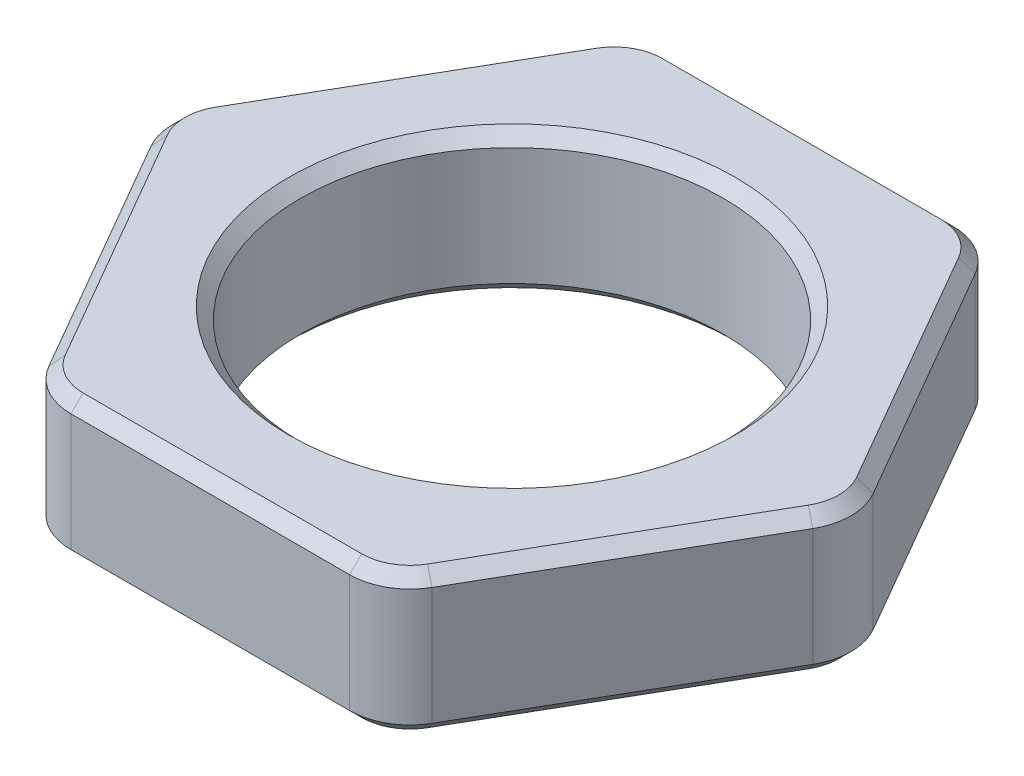
ISO-10303-21;
HEADER;
FILE_DESCRIPTION(('STEP AP214'),'2;1');
FILE_NAME('part.step','',(''),(''),'','','');
FILE_SCHEMA(('AUTOMOTIVE_DESIGN { 1 0 10303 214 1 1 1 1 }'));
ENDSEC;
DATA;
#1=APPLICATION_CONTEXT('core data for automotive mechanical design processes');
#2=APPLICATION_PROTOCOL_DEFINITION('international standard','automotive_design',2000,#1);
#3=PRODUCT_CONTEXT('',#1,'mechanical');
#4=PRODUCT('Part','Part','',(#3));
#5=PRODUCT_RELATED_PRODUCT_CATEGORY('part','',(#4));
#6=PRODUCT_DEFINITION_FORMATION('','',#4);
#7=PRODUCT_DEFINITION_CONTEXT('part definition',#1,'design');
#8=PRODUCT_DEFINITION('design','',#6,#7);
#9=PRODUCT_DEFINITION_SHAPE('','',#8);
#10=(LENGTH_UNIT() NAMED_UNIT(*) SI_UNIT(.MILLI.,.METRE.));
#11=(NAMED_UNIT(*) PLANE_ANGLE_UNIT() SI_UNIT($,.RADIAN.));
#12=(NAMED_UNIT(*) SI_UNIT($,.STERADIAN.) SOLID_ANGLE_UNIT());
#13=UNCERTAINTY_MEASURE_WITH_UNIT(LENGTH_MEASURE(1.E-05),#10,'distance_accuracy_value','');
#14=(GEOMETRIC_REPRESENTATION_CONTEXT(3) GLOBAL_UNCERTAINTY_ASSIGNED_CONTEXT((#13)) GLOBAL_UNIT_ASSIGNED_CONTEXT((#10,
#11,#12)) REPRESENTATION_CONTEXT('',''));
#15=CARTESIAN_POINT('',(0.,0.,0.));
#16=DIRECTION('',(0.,0.,1.));
#17=DIRECTION('',(1.,0.,0.));
#18=AXIS2_PLACEMENT_3D('',#15,#16,#17);
#19=CARTESIAN_POINT('',(0.,1.175,0.));
#20=DIRECTION('',(0.,1.,0.));
#21=DIRECTION('',(0.,0.,1.));
#22=AXIS2_PLACEMENT_3D('',#19,#20,#21);
#23=PLANE('',#22);
#24=CARTESIAN_POINT('',(0.,1.175,0.));
#25=DIRECTION('',(0.,1.,0.));
#26=DIRECTION('',(0.,0.,1.));
#27=AXIS2_PLACEMENT_3D('',#24,#25,#26);
#28=CIRCLE('',#27,3.7);
#29=CARTESIAN_POINT('',(0.,1.175,3.7));
#30=VERTEX_POINT('',#29);
#31=EDGE_CURVE('E11',#30,#30,#28,.F.);
#32=ORIENTED_EDGE('',*,*,#31,.T.);
#33=EDGE_LOOP('',(#32));
#34=FACE_BOUND('',#33,.T.);
#35=DIRECTION('',(1.,0.,0.));
#36=VECTOR('',#35,1.);
#37=CARTESIAN_POINT('',(2.3094010767585,1.175,4.8));
#38=LINE('',#37,#36);
#39=CARTESIAN_POINT('',(-2.3094010767585,1.175,4.8));
#40=VERTEX_POINT('',#39);
#41=CARTESIAN_POINT('',(2.3094010767585,1.175,4.8));
#42=VERTEX_POINT('',#41);
#43=EDGE_CURVE('E49',#40,#42,#38,.T.);
#44=ORIENTED_EDGE('',*,*,#43,.T.);
#45=CARTESIAN_POINT('',(2.3094010767585,1.175,4.));
#46=DIRECTION('',(0.,1.,0.));
#47=DIRECTION('',(0.,0.,1.));
#48=AXIS2_PLACEMENT_3D('',#45,#46,#47);
#49=CIRCLE('',#48,0.799999999999999);
#50=CARTESIAN_POINT('',(3.00222139978605,1.175,4.4));
#51=VERTEX_POINT('',#50);
#52=EDGE_CURVE('E41',#42,#51,#49,.T.);
#53=ORIENTED_EDGE('',*,*,#52,.T.);
#54=DIRECTION('',(0.5,0.,-0.866025403784439));
#55=VECTOR('',#54,1.);
#56=CARTESIAN_POINT('',(5.31162247654456,1.175,0.399999999999996));
#57=LINE('',#56,#55);
#58=CARTESIAN_POINT('',(5.31162247654456,1.175,0.399999999999997));
#59=VERTEX_POINT('',#58);
#60=EDGE_CURVE('E283',#51,#59,#57,.T.);
#61=ORIENTED_EDGE('',*,*,#60,.T.);
#62=CARTESIAN_POINT('',(4.61880215351701,1.175,0.));
#63=DIRECTION('',(0.,1.,0.));
#64=DIRECTION('',(0.,0.,1.));
#65=AXIS2_PLACEMENT_3D('',#62,#63,#64);
#66=CIRCLE('',#65,0.8);
#67=CARTESIAN_POINT('',(5.31162247654456,1.175,-0.400000000000003));
#68=VERTEX_POINT('',#67);
#69=EDGE_CURVE('E285',#59,#68,#66,.T.);
#70=ORIENTED_EDGE('',*,*,#69,.T.);
#71=DIRECTION('',(-0.5,0.,-0.866025403784439));
#72=VECTOR('',#71,1.);
#73=CARTESIAN_POINT('',(3.00222139978605,1.175,-4.4));
#74=LINE('',#73,#72);
#75=CARTESIAN_POINT('',(3.00222139978605,1.175,-4.4));
#76=VERTEX_POINT('',#75);
#77=EDGE_CURVE('E287',#68,#76,#74,.T.);
#78=ORIENTED_EDGE('',*,*,#77,.T.);
#79=CARTESIAN_POINT('',(2.3094010767585,1.175,-4.));
#80=DIRECTION('',(0.,1.,0.));
#81=DIRECTION('',(0.,0.,1.));
#82=AXIS2_PLACEMENT_3D('',#79,#80,#81);
#83=CIRCLE('',#82,0.799999999999999);
#84=CARTESIAN_POINT('',(2.3094010767585,1.175,-4.8));
#85=VERTEX_POINT('',#84);
#86=EDGE_CURVE('E289',#76,#85,#83,.T.);
#87=ORIENTED_EDGE('',*,*,#86,.T.);
#88=DIRECTION('',(-1.,0.,0.));
#89=VECTOR('',#88,1.);
#90=CARTESIAN_POINT('',(-2.3094010767585,1.175,-4.8));
#91=LINE('',#90,#89);
#92=CARTESIAN_POINT('',(-2.3094010767585,1.175,-4.8));
#93=VERTEX_POINT('',#92);
#94=EDGE_CURVE('E291',#85,#93,#91,.T.);
#95=ORIENTED_EDGE('',*,*,#94,.T.);
#96=CARTESIAN_POINT('',(-2.3094010767585,1.175,-4.));
#97=DIRECTION('',(0.,1.,0.));
#98=DIRECTION('',(0.,0.,1.));
#99=AXIS2_PLACEMENT_3D('',#96,#97,#98);
#100=CIRCLE('',#99,0.799999999999999);
#101=CARTESIAN_POINT('',(-3.00222139978605,1.175,-4.4));
#102=VERTEX_POINT('',#101);
#103=EDGE_CURVE('E293',#93,#102,#100,.T.);
#104=ORIENTED_EDGE('',*,*,#103,.T.);
#105=DIRECTION('',(-0.5,0.,0.866025403784439));
#106=VECTOR('',#105,1.);
#107=CARTESIAN_POINT('',(-5.31162247654456,1.175,-0.399999999999997));
#108=LINE('',#107,#106);
#109=CARTESIAN_POINT('',(-5.31162247654456,1.175,-0.399999999999999));
#110=VERTEX_POINT('',#109);
#111=EDGE_CURVE('E295',#102,#110,#108,.T.);
#112=ORIENTED_EDGE('',*,*,#111,.T.);
#113=CARTESIAN_POINT('',(-4.61880215351701,1.175,0.));
#114=DIRECTION('',(0.,1.,0.));
#115=DIRECTION('',(0.,0.,1.));
#116=AXIS2_PLACEMENT_3D('',#113,#114,#115);
#117=CIRCLE('',#116,0.8);
#118=CARTESIAN_POINT('',(-5.31162247654456,1.175,0.4));
#119=VERTEX_POINT('',#118);
#120=EDGE_CURVE('E297',#110,#119,#117,.T.);
#121=ORIENTED_EDGE('',*,*,#120,.T.);
#122=DIRECTION('',(0.5,0.,0.866025403784439));
#123=VECTOR('',#122,1.);
#124=CARTESIAN_POINT('',(-3.00222139978605,1.175,4.4));
#125=LINE('',#124,#123);
#126=CARTESIAN_POINT('',(-3.00222139978605,1.175,4.4));
#127=VERTEX_POINT('',#126);
#128=EDGE_CURVE('E299',#119,#127,#125,.T.);
#129=ORIENTED_EDGE('',*,*,#128,.T.);
#130=CARTESIAN_POINT('',(-2.3094010767585,1.175,4.));
#131=DIRECTION('',(0.,1.,0.));
#132=DIRECTION('',(0.,0.,1.));
#133=AXIS2_PLACEMENT_3D('',#130,#131,#132);
#134=CIRCLE('',#133,0.799999999999999);
#135=EDGE_CURVE('E54',#127,#40,#134,.T.);
#136=ORIENTED_EDGE('',*,*,#135,.T.);
#137=EDGE_LOOP('',(#44,#53,#61,#70,#78,#87,#95,#104,#112,#121,#129,#136));
#138=FACE_BOUND('',#137,.T.);
#139=ADVANCED_FACE('F32',(#34,#138),#23,.T.);
#140=CARTESIAN_POINT('',(0.,-1.175,0.));
#141=DIRECTION('',(0.,1.,0.));
#142=DIRECTION('',(0.,0.,1.));
#143=AXIS2_PLACEMENT_3D('',#140,#141,#142);
#144=PLANE('',#143);
#145=CARTESIAN_POINT('',(0.,-1.175,0.));
#146=DIRECTION('',(0.,1.,0.));
#147=DIRECTION('',(0.,0.,1.));
#148=AXIS2_PLACEMENT_3D('',#145,#146,#147);
#149=CIRCLE('',#148,3.7);
#150=CARTESIAN_POINT('',(0.,-1.175,3.7));
#151=VERTEX_POINT('',#150);
#152=EDGE_CURVE('E221',#151,#151,#149,.T.);
#153=ORIENTED_EDGE('',*,*,#152,.T.);
#154=EDGE_LOOP('',(#153));
#155=FACE_BOUND('',#154,.T.);
#156=DIRECTION('',(1.,0.,0.));
#157=VECTOR('',#156,1.);
#158=CARTESIAN_POINT('',(0.,-1.175,-4.8));
#159=LINE('',#158,#157);
#160=CARTESIAN_POINT('',(-2.3094010767585,-1.175,-4.8));
#161=VERTEX_POINT('',#160);
#162=CARTESIAN_POINT('',(2.3094010767585,-1.175,-4.8));
#163=VERTEX_POINT('',#162);
#164=EDGE_CURVE('E219',#161,#163,#159,.T.);
#165=ORIENTED_EDGE('',*,*,#164,.T.);
#166=CARTESIAN_POINT('',(2.3094010767585,-1.175,-4.));
#167=DIRECTION('',(0.,1.,0.));
#168=DIRECTION('',(0.,0.,1.));
#169=AXIS2_PLACEMENT_3D('',#166,#167,#168);
#170=CIRCLE('',#169,0.799999999999997);
#171=CARTESIAN_POINT('',(3.00222139978605,-1.175,-4.4));
#172=VERTEX_POINT('',#171);
#173=EDGE_CURVE('E200',#163,#172,#170,.F.);
#174=ORIENTED_EDGE('',*,*,#173,.T.);
#175=DIRECTION('',(0.5,0.,0.866025403784439));
#176=VECTOR('',#175,1.);
#177=CARTESIAN_POINT('',(4.15692193816531,-1.175,-2.4));
#178=LINE('',#177,#176);
#179=CARTESIAN_POINT('',(5.31162247654456,-1.175,-0.400000000000001));
#180=VERTEX_POINT('',#179);
#181=EDGE_CURVE('E208',#172,#180,#178,.T.);
#182=ORIENTED_EDGE('',*,*,#181,.T.);
#183=CARTESIAN_POINT('',(4.61880215351701,-1.175,0.));
#184=DIRECTION('',(0.,1.,0.));
#185=DIRECTION('',(0.,0.,1.));
#186=AXIS2_PLACEMENT_3D('',#183,#184,#185);
#187=CIRCLE('',#186,0.799999999999997);
#188=CARTESIAN_POINT('',(5.31162247654456,-1.175,0.399999999999996));
#189=VERTEX_POINT('',#188);
#190=EDGE_CURVE('E214',#180,#189,#187,.F.);
#191=ORIENTED_EDGE('',*,*,#190,.T.);
#192=DIRECTION('',(-0.5,0.,0.866025403784439));
#193=VECTOR('',#192,1.);
#194=CARTESIAN_POINT('',(4.1569219381653,-1.175,2.4));
#195=LINE('',#194,#193);
#196=CARTESIAN_POINT('',(3.00222139978605,-1.175,4.4));
#197=VERTEX_POINT('',#196);
#198=EDGE_CURVE('E397',#189,#197,#195,.T.);
#199=ORIENTED_EDGE('',*,*,#198,.T.);
#200=CARTESIAN_POINT('',(2.3094010767585,-1.175,4.));
#201=DIRECTION('',(0.,1.,0.));
#202=DIRECTION('',(0.,0.,1.));
#203=AXIS2_PLACEMENT_3D('',#200,#201,#202);
#204=CIRCLE('',#203,0.799999999999997);
#205=CARTESIAN_POINT('',(2.3094010767585,-1.175,4.8));
#206=VERTEX_POINT('',#205);
#207=EDGE_CURVE('E399',#197,#206,#204,.F.);
#208=ORIENTED_EDGE('',*,*,#207,.T.);
#209=DIRECTION('',(-1.,0.,0.));
#210=VECTOR('',#209,1.);
#211=CARTESIAN_POINT('',(0.,-1.175,4.8));
#212=LINE('',#211,#210);
#213=CARTESIAN_POINT('',(-2.3094010767585,-1.175,4.8));
#214=VERTEX_POINT('',#213);
#215=EDGE_CURVE('E401',#206,#214,#212,.T.);
#216=ORIENTED_EDGE('',*,*,#215,.T.);
#217=CARTESIAN_POINT('',(-2.3094010767585,-1.175,4.));
#218=DIRECTION('',(0.,1.,0.));
#219=DIRECTION('',(0.,0.,1.));
#220=AXIS2_PLACEMENT_3D('',#217,#218,#219);
#221=CIRCLE('',#220,0.799999999999997);
#222=CARTESIAN_POINT('',(-3.00222139978605,-1.175,4.4));
#223=VERTEX_POINT('',#222);
#224=EDGE_CURVE('E403',#214,#223,#221,.F.);
#225=ORIENTED_EDGE('',*,*,#224,.T.);
#226=DIRECTION('',(-0.5,0.,-0.866025403784439));
#227=VECTOR('',#226,1.);
#228=CARTESIAN_POINT('',(-4.1569219381653,-1.175,2.4));
#229=LINE('',#228,#227);
#230=CARTESIAN_POINT('',(-5.31162247654455,-1.175,0.399999999999998));
#231=VERTEX_POINT('',#230);
#232=EDGE_CURVE('E405',#223,#231,#229,.T.);
#233=ORIENTED_EDGE('',*,*,#232,.T.);
#234=CARTESIAN_POINT('',(-4.61880215351701,-1.175,0.));
#235=DIRECTION('',(0.,1.,0.));
#236=DIRECTION('',(0.,0.,1.));
#237=AXIS2_PLACEMENT_3D('',#234,#235,#236);
#238=CIRCLE('',#237,0.799999999999997);
#239=CARTESIAN_POINT('',(-5.31162247654455,-1.175,-0.399999999999997));
#240=VERTEX_POINT('',#239);
#241=EDGE_CURVE('E407',#231,#240,#238,.F.);
#242=ORIENTED_EDGE('',*,*,#241,.T.);
#243=DIRECTION('',(0.5,0.,-0.866025403784439));
#244=VECTOR('',#243,1.);
#245=CARTESIAN_POINT('',(-4.1569219381653,-1.175,-2.4));
#246=LINE('',#245,#244);
#247=CARTESIAN_POINT('',(-3.00222139978605,-1.175,-4.4));
#248=VERTEX_POINT('',#247);
#249=EDGE_CURVE('E409',#240,#248,#246,.T.);
#250=ORIENTED_EDGE('',*,*,#249,.T.);
#251=CARTESIAN_POINT('',(-2.3094010767585,-1.175,-4.));
#252=DIRECTION('',(0.,1.,0.));
#253=DIRECTION('',(0.,0.,1.));
#254=AXIS2_PLACEMENT_3D('',#251,#252,#253);
#255=CIRCLE('',#254,0.799999999999997);
#256=EDGE_CURVE('E226',#248,#161,#255,.F.);
#257=ORIENTED_EDGE('',*,*,#256,.T.);
#258=EDGE_LOOP('',(#165,#174,#182,#191,#199,#208,#216,#225,#233,#242,#250,#257));
#259=FACE_BOUND('',#258,.T.);
#260=ADVANCED_FACE('F217',(#155,#259),#144,.F.);
#261=CARTESIAN_POINT('',(5.77350269189626,1.175,0.));
#262=DIRECTION('',(-0.866025403784439,0.,0.5));
#263=DIRECTION('',(0.5,0.,0.866025403784439));
#264=AXIS2_PLACEMENT_3D('',#261,#262,#263);
#265=PLANE('',#264);
#266=DIRECTION('',(0.,-1.,0.));
#267=VECTOR('',#266,1.);
#268=CARTESIAN_POINT('',(5.48482755730145,1.175,-0.500000000000003));
#269=LINE('',#268,#267);
#270=CARTESIAN_POINT('',(5.48482755730145,0.975,-0.500000000000003));
#271=VERTEX_POINT('',#270);
#272=CARTESIAN_POINT('',(5.48482755730145,-0.974999999999997,-0.500000000000003));
#273=VERTEX_POINT('',#272);
#274=EDGE_CURVE('E426',#271,#273,#269,.T.);
#275=ORIENTED_EDGE('',*,*,#274,.T.);
#276=DIRECTION('',(-0.5,0.,-0.866025403784439));
#277=VECTOR('',#276,1.);
#278=CARTESIAN_POINT('',(5.77350269189626,-0.974999999999997,0.));
#279=LINE('',#278,#277);
#280=CARTESIAN_POINT('',(3.17542648054294,-0.974999999999997,-4.5));
#281=VERTEX_POINT('',#280);
#282=EDGE_CURVE('E281',#273,#281,#279,.T.);
#283=ORIENTED_EDGE('',*,*,#282,.T.);
#284=DIRECTION('',(0.,-1.,0.));
#285=VECTOR('',#284,1.);
#286=CARTESIAN_POINT('',(3.17542648054294,1.175,-4.5));
#287=LINE('',#286,#285);
#288=CARTESIAN_POINT('',(3.17542648054294,0.975,-4.5));
#289=VERTEX_POINT('',#288);
#290=EDGE_CURVE('E333',#281,#289,#287,.F.);
#291=ORIENTED_EDGE('',*,*,#290,.T.);
#292=DIRECTION('',(0.5,0.,0.866025403784439));
#293=VECTOR('',#292,1.);
#294=CARTESIAN_POINT('',(5.48482755730145,0.975,-0.500000000000003));
#295=LINE('',#294,#293);
#296=EDGE_CURVE('E279',#289,#271,#295,.T.);
#297=ORIENTED_EDGE('',*,*,#296,.T.);
#298=EDGE_LOOP('',(#275,#283,#291,#297));
#299=FACE_BOUND('',#298,.T.);
#300=ADVANCED_FACE('F484',(#299),#265,.F.);
#301=CARTESIAN_POINT('',(2.88675134594813,1.175,-5.));
#302=DIRECTION('',(0.,0.,1.));
#303=DIRECTION('',(1.,0.,0.));
#304=AXIS2_PLACEMENT_3D('',#301,#302,#303);
#305=PLANE('',#304);
#306=DIRECTION('',(0.,-1.,0.));
#307=VECTOR('',#306,1.);
#308=CARTESIAN_POINT('',(2.3094010767585,1.175,-5.));
#309=LINE('',#308,#307);
#310=CARTESIAN_POINT('',(2.3094010767585,0.975,-5.));
#311=VERTEX_POINT('',#310);
#312=CARTESIAN_POINT('',(2.3094010767585,-0.974999999999998,-5.));
#313=VERTEX_POINT('',#312);
#314=EDGE_CURVE('E390',#311,#313,#309,.T.);
#315=ORIENTED_EDGE('',*,*,#314,.T.);
#316=DIRECTION('',(-1.,0.,0.));
#317=VECTOR('',#316,1.);
#318=CARTESIAN_POINT('',(2.88675134594813,-0.974999999999998,-5.));
#319=LINE('',#318,#317);
#320=CARTESIAN_POINT('',(-2.3094010767585,-0.974999999999998,-5.));
#321=VERTEX_POINT('',#320);
#322=EDGE_CURVE('E240',#313,#321,#319,.T.);
#323=ORIENTED_EDGE('',*,*,#322,.T.);
#324=DIRECTION('',(0.,-1.,0.));
#325=VECTOR('',#324,1.);
#326=CARTESIAN_POINT('',(-2.3094010767585,1.175,-5.));
#327=LINE('',#326,#325);
#328=CARTESIAN_POINT('',(-2.3094010767585,0.975,-5.));
#329=VERTEX_POINT('',#328);
#330=EDGE_CURVE('E215',#321,#329,#327,.F.);
#331=ORIENTED_EDGE('',*,*,#330,.T.);
#332=DIRECTION('',(1.,0.,0.));
#333=VECTOR('',#332,1.);
#334=CARTESIAN_POINT('',(2.3094010767585,0.975,-5.));
#335=LINE('',#334,#333);
#336=EDGE_CURVE('E238',#329,#311,#335,.T.);
#337=ORIENTED_EDGE('',*,*,#336,.T.);
#338=EDGE_LOOP('',(#315,#323,#331,#337));
#339=FACE_BOUND('',#338,.T.);
#340=ADVANCED_FACE('F387',(#339),#305,.F.);
#341=CARTESIAN_POINT('',(-2.88675134594813,1.175,-5.));
#342=DIRECTION('',(0.866025403784439,0.,0.5));
#343=DIRECTION('',(0.5,0.,-0.866025403784439));
#344=AXIS2_PLACEMENT_3D('',#341,#342,#343);
#345=PLANE('',#344);
#346=DIRECTION('',(0.,-1.,0.));
#347=VECTOR('',#346,1.);
#348=CARTESIAN_POINT('',(-3.17542648054294,1.175,-4.5));
#349=LINE('',#348,#347);
#350=CARTESIAN_POINT('',(-3.17542648054294,0.975,-4.5));
#351=VERTEX_POINT('',#350);
#352=CARTESIAN_POINT('',(-3.17542648054294,-0.974999999999998,-4.5));
#353=VERTEX_POINT('',#352);
#354=EDGE_CURVE('E384',#351,#353,#349,.T.);
#355=ORIENTED_EDGE('',*,*,#354,.T.);
#356=DIRECTION('',(-0.5,0.,0.866025403784439));
#357=VECTOR('',#356,1.);
#358=CARTESIAN_POINT('',(-2.88675134594813,-0.974999999999998,-5.));
#359=LINE('',#358,#357);
#360=CARTESIAN_POINT('',(-5.48482755730145,-0.974999999999998,-0.5));
#361=VERTEX_POINT('',#360);
#362=EDGE_CURVE('E248',#353,#361,#359,.T.);
#363=ORIENTED_EDGE('',*,*,#362,.T.);
#364=DIRECTION('',(0.,-1.,0.));
#365=VECTOR('',#364,1.);
#366=CARTESIAN_POINT('',(-5.48482755730145,1.175,-0.5));
#367=LINE('',#366,#365);
#368=CARTESIAN_POINT('',(-5.48482755730145,0.974999999999999,-0.5));
#369=VERTEX_POINT('',#368);
#370=EDGE_CURVE('E392',#361,#369,#367,.F.);
#371=ORIENTED_EDGE('',*,*,#370,.T.);
#372=DIRECTION('',(0.5,0.,-0.866025403784439));
#373=VECTOR('',#372,1.);
#374=CARTESIAN_POINT('',(-3.17542648054294,0.974999999999999,-4.5));
#375=LINE('',#374,#373);
#376=EDGE_CURVE('E246',#369,#351,#375,.T.);
#377=ORIENTED_EDGE('',*,*,#376,.T.);
#378=EDGE_LOOP('',(#355,#363,#371,#377));
#379=FACE_BOUND('',#378,.T.);
#380=ADVANCED_FACE('F452',(#379),#345,.F.);
#381=CARTESIAN_POINT('',(-5.77350269189626,1.175,0.));
#382=DIRECTION('',(0.866025403784439,0.,-0.5));
#383=DIRECTION('',(-0.5,0.,-0.866025403784439));
#384=AXIS2_PLACEMENT_3D('',#381,#382,#383);
#385=PLANE('',#384);
#386=DIRECTION('',(0.,-1.,0.));
#387=VECTOR('',#386,1.);
#388=CARTESIAN_POINT('',(-5.48482755730145,1.175,0.5));
#389=LINE('',#388,#387);
#390=CARTESIAN_POINT('',(-5.48482755730145,0.975,0.5));
#391=VERTEX_POINT('',#390);
#392=CARTESIAN_POINT('',(-5.48482755730145,-0.974999999999998,0.5));
#393=VERTEX_POINT('',#392);
#394=EDGE_CURVE('E446',#391,#393,#389,.T.);
#395=ORIENTED_EDGE('',*,*,#394,.T.);
#396=DIRECTION('',(0.5,0.,0.866025403784439));
#397=VECTOR('',#396,1.);
#398=CARTESIAN_POINT('',(-5.77350269189626,-0.974999999999998,0.));
#399=LINE('',#398,#397);
#400=CARTESIAN_POINT('',(-3.17542648054294,-0.974999999999998,4.5));
#401=VERTEX_POINT('',#400);
#402=EDGE_CURVE('E256',#393,#401,#399,.T.);
#403=ORIENTED_EDGE('',*,*,#402,.T.);
#404=DIRECTION('',(0.,-1.,0.));
#405=VECTOR('',#404,1.);
#406=CARTESIAN_POINT('',(-3.17542648054294,1.175,4.5));
#407=LINE('',#406,#405);
#408=CARTESIAN_POINT('',(-3.17542648054294,0.975,4.5));
#409=VERTEX_POINT('',#408);
#410=EDGE_CURVE('E443',#401,#409,#407,.F.);
#411=ORIENTED_EDGE('',*,*,#410,.T.);
#412=DIRECTION('',(-0.5,0.,-0.866025403784439));
#413=VECTOR('',#412,1.);
#414=CARTESIAN_POINT('',(-5.48482755730145,0.975,0.5));
#415=LINE('',#414,#413);
#416=EDGE_CURVE('E254',#409,#391,#415,.T.);
#417=ORIENTED_EDGE('',*,*,#416,.T.);
#418=EDGE_LOOP('',(#395,#403,#411,#417));
#419=FACE_BOUND('',#418,.T.);
#420=ADVANCED_FACE('F497',(#419),#385,.F.);
#421=CARTESIAN_POINT('',(-2.88675134594813,1.175,5.));
#422=DIRECTION('',(0.,0.,-1.));
#423=DIRECTION('',(-1.,0.,0.));
#424=AXIS2_PLACEMENT_3D('',#421,#422,#423);
#425=PLANE('',#424);
#426=DIRECTION('',(0.,-1.,0.));
#427=VECTOR('',#426,1.);
#428=CARTESIAN_POINT('',(-2.3094010767585,1.175,5.));
#429=LINE('',#428,#427);
#430=CARTESIAN_POINT('',(-2.3094010767585,0.975,5.));
#431=VERTEX_POINT('',#430);
#432=CARTESIAN_POINT('',(-2.3094010767585,-0.974999999999998,5.));
#433=VERTEX_POINT('',#432);
#434=EDGE_CURVE('E437',#431,#433,#429,.T.);
#435=ORIENTED_EDGE('',*,*,#434,.T.);
#436=DIRECTION('',(1.,0.,0.));
#437=VECTOR('',#436,1.);
#438=CARTESIAN_POINT('',(-2.88675134594813,-0.974999999999998,5.));
#439=LINE('',#438,#437);
#440=CARTESIAN_POINT('',(2.3094010767585,-0.974999999999998,5.));
#441=VERTEX_POINT('',#440);
#442=EDGE_CURVE('E264',#433,#441,#439,.T.);
#443=ORIENTED_EDGE('',*,*,#442,.T.);
#444=DIRECTION('',(0.,-1.,0.));
#445=VECTOR('',#444,1.);
#446=CARTESIAN_POINT('',(2.3094010767585,1.175,5.));
#447=LINE('',#446,#445);
#448=CARTESIAN_POINT('',(2.3094010767585,0.975,5.));
#449=VERTEX_POINT('',#448);
#450=EDGE_CURVE('E440',#441,#449,#447,.F.);
#451=ORIENTED_EDGE('',*,*,#450,.T.);
#452=DIRECTION('',(-1.,0.,0.));
#453=VECTOR('',#452,1.);
#454=CARTESIAN_POINT('',(-2.3094010767585,0.975,5.));
#455=LINE('',#454,#453);
#456=EDGE_CURVE('E262',#449,#431,#455,.T.);
#457=ORIENTED_EDGE('',*,*,#456,.T.);
#458=EDGE_LOOP('',(#435,#443,#451,#457));
#459=FACE_BOUND('',#458,.T.);
#460=ADVANCED_FACE('F493',(#459),#425,.F.);
#461=CARTESIAN_POINT('',(2.88675134594813,1.175,5.));
#462=DIRECTION('',(-0.866025403784439,0.,-0.5));
#463=DIRECTION('',(-0.5,0.,0.866025403784439));
#464=AXIS2_PLACEMENT_3D('',#461,#462,#463);
#465=PLANE('',#464);
#466=DIRECTION('',(0.,-1.,0.));
#467=VECTOR('',#466,1.);
#468=CARTESIAN_POINT('',(3.17542648054294,1.175,4.5));
#469=LINE('',#468,#467);
#470=CARTESIAN_POINT('',(3.17542648054294,0.974999999999999,4.5));
#471=VERTEX_POINT('',#470);
#472=CARTESIAN_POINT('',(3.17542648054294,-0.974999999999998,4.5));
#473=VERTEX_POINT('',#472);
#474=EDGE_CURVE('E429',#471,#473,#469,.T.);
#475=ORIENTED_EDGE('',*,*,#474,.T.);
#476=DIRECTION('',(0.5,0.,-0.866025403784439));
#477=VECTOR('',#476,1.);
#478=CARTESIAN_POINT('',(2.88675134594813,-0.974999999999998,5.));
#479=LINE('',#478,#477);
#480=CARTESIAN_POINT('',(5.48482755730145,-0.974999999999998,0.499999999999997));
#481=VERTEX_POINT('',#480);
#482=EDGE_CURVE('E273',#473,#481,#479,.T.);
#483=ORIENTED_EDGE('',*,*,#482,.T.);
#484=DIRECTION('',(0.,-1.,0.));
#485=VECTOR('',#484,1.);
#486=CARTESIAN_POINT('',(5.48482755730145,1.175,0.499999999999997));
#487=LINE('',#486,#485);
#488=CARTESIAN_POINT('',(5.48482755730145,0.975,0.499999999999997));
#489=VERTEX_POINT('',#488);
#490=EDGE_CURVE('E434',#481,#489,#487,.F.);
#491=ORIENTED_EDGE('',*,*,#490,.T.);
#492=DIRECTION('',(-0.5,0.,0.866025403784439));
#493=VECTOR('',#492,1.);
#494=CARTESIAN_POINT('',(3.17542648054294,0.974999999999999,4.5));
#495=LINE('',#494,#493);
#496=EDGE_CURVE('E271',#489,#471,#495,.T.);
#497=ORIENTED_EDGE('',*,*,#496,.T.);
#498=EDGE_LOOP('',(#475,#483,#491,#497));
#499=FACE_BOUND('',#498,.T.);
#500=ADVANCED_FACE('F490',(#499),#465,.F.);
#501=CARTESIAN_POINT('',(0.,1.175,0.));
#502=DIRECTION('',(0.,-1.,0.));
#503=DIRECTION('',(0.,0.,-1.));
#504=AXIS2_PLACEMENT_3D('',#501,#502,#503);
#505=CYLINDRICAL_SURFACE('',#504,3.5);
#506=CARTESIAN_POINT('',(0.,-0.974999999999997,0.));
#507=DIRECTION('',(0.,1.,0.));
#508=DIRECTION('',(0.,0.,1.));
#509=AXIS2_PLACEMENT_3D('',#506,#507,#508);
#510=CIRCLE('',#509,3.5);
#511=CARTESIAN_POINT('',(0.,-0.974999999999997,3.5));
#512=VERTEX_POINT('',#511);
#513=EDGE_CURVE('E232',#512,#512,#510,.F.);
#514=ORIENTED_EDGE('',*,*,#513,.T.);
#515=EDGE_LOOP('',(#514));
#516=FACE_BOUND('',#515,.T.);
#517=CARTESIAN_POINT('',(0.,0.975,0.));
#518=DIRECTION('',(0.,1.,0.));
#519=DIRECTION('',(0.,0.,1.));
#520=AXIS2_PLACEMENT_3D('',#517,#518,#519);
#521=CIRCLE('',#520,3.5);
#522=CARTESIAN_POINT('',(0.,0.975,3.5));
#523=VERTEX_POINT('',#522);
#524=EDGE_CURVE('E224',#523,#523,#521,.T.);
#525=ORIENTED_EDGE('',*,*,#524,.T.);
#526=EDGE_LOOP('',(#525));
#527=FACE_BOUND('',#526,.T.);
#528=ADVANCED_FACE('F488',(#516,#527),#505,.F.);
#529=CARTESIAN_POINT('',(4.61880215351701,1.175,0.));
#530=DIRECTION('',(0.,-1.,0.));
#531=DIRECTION('',(0.,0.,-1.));
#532=AXIS2_PLACEMENT_3D('',#529,#530,#531);
#533=CYLINDRICAL_SURFACE('',#532,1.);
#534=ORIENTED_EDGE('',*,*,#490,.F.);
#535=CARTESIAN_POINT('',(4.61880215351701,-0.974999999999998,0.));
#536=DIRECTION('',(0.,1.,0.));
#537=DIRECTION('',(0.,0.,1.));
#538=AXIS2_PLACEMENT_3D('',#535,#536,#537);
#539=CIRCLE('',#538,1.);
#540=EDGE_CURVE('E277',#481,#273,#539,.T.);
#541=ORIENTED_EDGE('',*,*,#540,.T.);
#542=ORIENTED_EDGE('',*,*,#274,.F.);
#543=CARTESIAN_POINT('',(4.61880215351701,0.975,0.));
#544=DIRECTION('',(0.,1.,0.));
#545=DIRECTION('',(0.,0.,1.));
#546=AXIS2_PLACEMENT_3D('',#543,#544,#545);
#547=CIRCLE('',#546,1.);
#548=EDGE_CURVE('E275',#271,#489,#547,.F.);
#549=ORIENTED_EDGE('',*,*,#548,.T.);
#550=EDGE_LOOP('',(#534,#541,#542,#549));
#551=FACE_BOUND('',#550,.T.);
#552=ADVANCED_FACE('F508',(#551),#533,.T.);
#553=CARTESIAN_POINT('',(2.3094010767585,1.175,4.));
#554=DIRECTION('',(0.,-1.,0.));
#555=DIRECTION('',(0.,0.,-1.));
#556=AXIS2_PLACEMENT_3D('',#553,#554,#555);
#557=CYLINDRICAL_SURFACE('',#556,1.);
#558=ORIENTED_EDGE('',*,*,#450,.F.);
#559=CARTESIAN_POINT('',(2.3094010767585,-0.974999999999998,4.));
#560=DIRECTION('',(0.,1.,0.));
#561=DIRECTION('',(0.,0.,1.));
#562=AXIS2_PLACEMENT_3D('',#559,#560,#561);
#563=CIRCLE('',#562,1.);
#564=EDGE_CURVE('E269',#441,#473,#563,.T.);
#565=ORIENTED_EDGE('',*,*,#564,.T.);
#566=ORIENTED_EDGE('',*,*,#474,.F.);
#567=CARTESIAN_POINT('',(2.3094010767585,0.975,4.));
#568=DIRECTION('',(0.,1.,0.));
#569=DIRECTION('',(0.,0.,1.));
#570=AXIS2_PLACEMENT_3D('',#567,#568,#569);
#571=CIRCLE('',#570,1.);
#572=EDGE_CURVE('E266',#471,#449,#571,.F.);
#573=ORIENTED_EDGE('',*,*,#572,.T.);
#574=EDGE_LOOP('',(#558,#565,#566,#573));
#575=FACE_BOUND('',#574,.T.);
#576=ADVANCED_FACE('F511',(#575),#557,.T.);
#577=CARTESIAN_POINT('',(-4.61880215351701,1.175,0.));
#578=DIRECTION('',(0.,-1.,0.));
#579=DIRECTION('',(0.,0.,-1.));
#580=AXIS2_PLACEMENT_3D('',#577,#578,#579);
#581=CYLINDRICAL_SURFACE('',#580,1.);
#582=ORIENTED_EDGE('',*,*,#370,.F.);
#583=CARTESIAN_POINT('',(-4.61880215351701,-0.974999999999998,0.));
#584=DIRECTION('',(0.,1.,0.));
#585=DIRECTION('',(0.,0.,1.));
#586=AXIS2_PLACEMENT_3D('',#583,#584,#585);
#587=CIRCLE('',#586,1.);
#588=EDGE_CURVE('E252',#361,#393,#587,.T.);
#589=ORIENTED_EDGE('',*,*,#588,.T.);
#590=ORIENTED_EDGE('',*,*,#394,.F.);
#591=CARTESIAN_POINT('',(-4.61880215351701,0.975,0.));
#592=DIRECTION('',(0.,1.,0.));
#593=DIRECTION('',(0.,0.,1.));
#594=AXIS2_PLACEMENT_3D('',#591,#592,#593);
#595=CIRCLE('',#594,1.);
#596=EDGE_CURVE('E250',#391,#369,#595,.F.);
#597=ORIENTED_EDGE('',*,*,#596,.T.);
#598=EDGE_LOOP('',(#582,#589,#590,#597));
#599=FACE_BOUND('',#598,.T.);
#600=ADVANCED_FACE('F456',(#599),#581,.T.);
#601=CARTESIAN_POINT('',(-2.3094010767585,1.175,-4.));
#602=DIRECTION('',(0.,-1.,0.));
#603=DIRECTION('',(0.,0.,-1.));
#604=AXIS2_PLACEMENT_3D('',#601,#602,#603);
#605=CYLINDRICAL_SURFACE('',#604,1.);
#606=ORIENTED_EDGE('',*,*,#330,.F.);
#607=CARTESIAN_POINT('',(-2.3094010767585,-0.974999999999998,-4.));
#608=DIRECTION('',(0.,1.,0.));
#609=DIRECTION('',(0.,0.,1.));
#610=AXIS2_PLACEMENT_3D('',#607,#608,#609);
#611=CIRCLE('',#610,1.);
#612=EDGE_CURVE('E244',#321,#353,#611,.T.);
#613=ORIENTED_EDGE('',*,*,#612,.T.);
#614=ORIENTED_EDGE('',*,*,#354,.F.);
#615=CARTESIAN_POINT('',(-2.3094010767585,0.975,-4.));
#616=DIRECTION('',(0.,1.,0.));
#617=DIRECTION('',(0.,0.,1.));
#618=AXIS2_PLACEMENT_3D('',#615,#616,#617);
#619=CIRCLE('',#618,1.);
#620=EDGE_CURVE('E242',#351,#329,#619,.F.);
#621=ORIENTED_EDGE('',*,*,#620,.T.);
#622=EDGE_LOOP('',(#606,#613,#614,#621));
#623=FACE_BOUND('',#622,.T.);
#624=ADVANCED_FACE('F381',(#623),#605,.T.);
#625=CARTESIAN_POINT('',(2.3094010767585,1.175,-4.));
#626=DIRECTION('',(0.,-1.,0.));
#627=DIRECTION('',(0.,0.,-1.));
#628=AXIS2_PLACEMENT_3D('',#625,#626,#627);
#629=CYLINDRICAL_SURFACE('',#628,1.);
#630=ORIENTED_EDGE('',*,*,#290,.F.);
#631=CARTESIAN_POINT('',(2.3094010767585,-0.974999999999998,-4.));
#632=DIRECTION('',(0.,1.,0.));
#633=DIRECTION('',(0.,0.,1.));
#634=AXIS2_PLACEMENT_3D('',#631,#632,#633);
#635=CIRCLE('',#634,1.);
#636=EDGE_CURVE('E202',#281,#313,#635,.T.);
#637=ORIENTED_EDGE('',*,*,#636,.T.);
#638=ORIENTED_EDGE('',*,*,#314,.F.);
#639=CARTESIAN_POINT('',(2.3094010767585,0.975,-4.));
#640=DIRECTION('',(0.,1.,0.));
#641=DIRECTION('',(0.,0.,1.));
#642=AXIS2_PLACEMENT_3D('',#639,#640,#641);
#643=CIRCLE('',#642,1.);
#644=EDGE_CURVE('E235',#311,#289,#643,.F.);
#645=ORIENTED_EDGE('',*,*,#644,.T.);
#646=EDGE_LOOP('',(#630,#637,#638,#645));
#647=FACE_BOUND('',#646,.T.);
#648=ADVANCED_FACE('F420',(#647),#629,.T.);
#649=CARTESIAN_POINT('',(-2.3094010767585,1.175,4.));
#650=DIRECTION('',(0.,-1.,0.));
#651=DIRECTION('',(0.,0.,-1.));
#652=AXIS2_PLACEMENT_3D('',#649,#650,#651);
#653=CYLINDRICAL_SURFACE('',#652,1.);
#654=ORIENTED_EDGE('',*,*,#410,.F.);
#655=CARTESIAN_POINT('',(-2.3094010767585,-0.974999999999998,4.));
#656=DIRECTION('',(0.,1.,0.));
#657=DIRECTION('',(0.,0.,1.));
#658=AXIS2_PLACEMENT_3D('',#655,#656,#657);
#659=CIRCLE('',#658,1.);
#660=EDGE_CURVE('E260',#401,#433,#659,.T.);
#661=ORIENTED_EDGE('',*,*,#660,.T.);
#662=ORIENTED_EDGE('',*,*,#434,.F.);
#663=CARTESIAN_POINT('',(-2.3094010767585,0.975,4.));
#664=DIRECTION('',(0.,1.,0.));
#665=DIRECTION('',(0.,0.,1.));
#666=AXIS2_PLACEMENT_3D('',#663,#664,#665);
#667=CIRCLE('',#666,1.);
#668=EDGE_CURVE('E258',#431,#409,#667,.F.);
#669=ORIENTED_EDGE('',*,*,#668,.T.);
#670=EDGE_LOOP('',(#654,#661,#662,#669));
#671=FACE_BOUND('',#670,.T.);
#672=ADVANCED_FACE('F522',(#671),#653,.T.);
#673=CARTESIAN_POINT('',(0.,-1.175,0.));
#674=DIRECTION('',(0.,-1.,0.));
#675=DIRECTION('',(0.,0.,-1.));
#676=AXIS2_PLACEMENT_3D('',#673,#674,#675);
#677=CONICAL_SURFACE('',#676,3.7,0.785398163397443);
#678=ORIENTED_EDGE('',*,*,#513,.F.);
#679=EDGE_LOOP('',(#678));
#680=FACE_BOUND('',#679,.T.);
#681=ORIENTED_EDGE('',*,*,#152,.F.);
#682=EDGE_LOOP('',(#681));
#683=FACE_BOUND('',#682,.T.);
#684=ADVANCED_FACE('F525',(#680,#683),#677,.F.);
#685=CARTESIAN_POINT('',(-2.3094010767585,-1.175,4.));
#686=DIRECTION('',(0.,1.,0.));
#687=DIRECTION('',(0.,0.,1.));
#688=AXIS2_PLACEMENT_3D('',#685,#686,#687);
#689=CONICAL_SURFACE('',#688,0.799999999999997,0.78539816339745);
#690=DIRECTION('',(0.,-0.707106781186546,-0.707106781186549));
#691=VECTOR('',#690,1.);
#692=CARTESIAN_POINT('',(-2.3094010767585,-0.974999999999998,5.));
#693=LINE('',#692,#691);
#694=EDGE_CURVE('E327',#433,#214,#693,.T.);
#695=ORIENTED_EDGE('',*,*,#694,.F.);
#696=ORIENTED_EDGE('',*,*,#660,.F.);
#697=DIRECTION('',(-0.612372435695796,0.707106781186547,0.353553390593273));
#698=VECTOR('',#697,1.);
#699=CARTESIAN_POINT('',(-3.00222139978605,-1.175,4.4));
#700=LINE('',#699,#698);
#701=EDGE_CURVE('E330',#223,#401,#700,.T.);
#702=ORIENTED_EDGE('',*,*,#701,.F.);
#703=ORIENTED_EDGE('',*,*,#224,.F.);
#704=EDGE_LOOP('',(#695,#696,#702,#703));
#705=FACE_BOUND('',#704,.T.);
#706=ADVANCED_FACE('F529',(#705),#689,.T.);
#707=CARTESIAN_POINT('',(-5.77350269189626,-0.974999999999998,0.));
#708=DIRECTION('',(0.612372435695794,0.707106781186548,-0.353553390593274));
#709=DIRECTION('',(0.5,0.,0.866025403784439));
#710=AXIS2_PLACEMENT_3D('',#707,#708,#709);
#711=PLANE('',#710);
#712=ORIENTED_EDGE('',*,*,#701,.T.);
#713=ORIENTED_EDGE('',*,*,#402,.F.);
#714=DIRECTION('',(-0.612372435695795,0.707106781186547,0.353553390593275));
#715=VECTOR('',#714,1.);
#716=CARTESIAN_POINT('',(-5.31162247654455,-1.175,0.399999999999998));
#717=LINE('',#716,#715);
#718=EDGE_CURVE('E324',#231,#393,#717,.T.);
#719=ORIENTED_EDGE('',*,*,#718,.F.);
#720=ORIENTED_EDGE('',*,*,#232,.F.);
#721=EDGE_LOOP('',(#712,#713,#719,#720));
#722=FACE_BOUND('',#721,.T.);
#723=ADVANCED_FACE('F724',(#722),#711,.F.);
#724=CARTESIAN_POINT('',(-2.88675134594813,-0.974999999999998,5.));
#725=DIRECTION('',(0.,0.707106781186549,-0.707106781186546));
#726=DIRECTION('',(1.,0.,0.));
#727=AXIS2_PLACEMENT_3D('',#724,#725,#726);
#728=PLANE('',#727);
#729=ORIENTED_EDGE('',*,*,#694,.T.);
#730=ORIENTED_EDGE('',*,*,#215,.F.);
#731=DIRECTION('',(0.,-0.707106781186546,-0.707106781186549));
#732=VECTOR('',#731,1.);
#733=CARTESIAN_POINT('',(2.3094010767585,-0.974999999999998,5.));
#734=LINE('',#733,#732);
#735=EDGE_CURVE('E321',#441,#206,#734,.T.);
#736=ORIENTED_EDGE('',*,*,#735,.F.);
#737=ORIENTED_EDGE('',*,*,#442,.F.);
#738=EDGE_LOOP('',(#729,#730,#736,#737));
#739=FACE_BOUND('',#738,.T.);
#740=ADVANCED_FACE('F716',(#739),#728,.F.);
#741=CARTESIAN_POINT('',(-4.61880215351701,-1.175,0.));
#742=DIRECTION('',(0.,1.,0.));
#743=DIRECTION('',(0.,0.,1.));
#744=AXIS2_PLACEMENT_3D('',#741,#742,#743);
#745=CONICAL_SURFACE('',#744,0.799999999999997,0.785398163397451);
#746=ORIENTED_EDGE('',*,*,#718,.T.);
#747=ORIENTED_EDGE('',*,*,#588,.F.);
#748=DIRECTION('',(-0.612372435695796,0.707106781186545,-0.353553390593276));
#749=VECTOR('',#748,1.);
#750=CARTESIAN_POINT('',(-5.31162247654455,-1.175,-0.399999999999997));
#751=LINE('',#750,#749);
#752=EDGE_CURVE('E318',#240,#361,#751,.T.);
#753=ORIENTED_EDGE('',*,*,#752,.F.);
#754=ORIENTED_EDGE('',*,*,#241,.F.);
#755=EDGE_LOOP('',(#746,#747,#753,#754));
#756=FACE_BOUND('',#755,.T.);
#757=ADVANCED_FACE('F461',(#756),#745,.T.);
#758=CARTESIAN_POINT('',(2.3094010767585,-1.175,4.));
#759=DIRECTION('',(0.,1.,0.));
#760=DIRECTION('',(0.,0.,1.));
#761=AXIS2_PLACEMENT_3D('',#758,#759,#760);
#762=CONICAL_SURFACE('',#761,0.799999999999997,0.78539816339745);
#763=ORIENTED_EDGE('',*,*,#735,.T.);
#764=ORIENTED_EDGE('',*,*,#207,.F.);
#765=DIRECTION('',(-0.612372435695796,-0.707106781186547,-0.353553390593273));
#766=VECTOR('',#765,1.);
#767=CARTESIAN_POINT('',(3.17542648054294,-0.974999999999998,4.5));
#768=LINE('',#767,#766);
#769=EDGE_CURVE('E315',#473,#197,#768,.T.);
#770=ORIENTED_EDGE('',*,*,#769,.F.);
#771=ORIENTED_EDGE('',*,*,#564,.F.);
#772=EDGE_LOOP('',(#763,#764,#770,#771));
#773=FACE_BOUND('',#772,.T.);
#774=ADVANCED_FACE('F468',(#773),#762,.T.);
#775=CARTESIAN_POINT('',(-2.88675134594813,-0.974999999999998,-5.));
#776=DIRECTION('',(0.612372435695794,0.707106781186548,0.353553390593273));
#777=DIRECTION('',(-0.5,0.,0.866025403784439));
#778=AXIS2_PLACEMENT_3D('',#775,#776,#777);
#779=PLANE('',#778);
#780=ORIENTED_EDGE('',*,*,#752,.T.);
#781=ORIENTED_EDGE('',*,*,#362,.F.);
#782=DIRECTION('',(-0.612372435695797,0.707106781186546,-0.353553390593274));
#783=VECTOR('',#782,1.);
#784=CARTESIAN_POINT('',(-3.00222139978605,-1.175,-4.4));
#785=LINE('',#784,#783);
#786=EDGE_CURVE('E312',#248,#353,#785,.T.);
#787=ORIENTED_EDGE('',*,*,#786,.F.);
#788=ORIENTED_EDGE('',*,*,#249,.F.);
#789=EDGE_LOOP('',(#780,#781,#787,#788));
#790=FACE_BOUND('',#789,.T.);
#791=ADVANCED_FACE('F465',(#790),#779,.F.);
#792=CARTESIAN_POINT('',(2.88675134594813,-0.974999999999998,5.));
#793=DIRECTION('',(-0.612372435695794,0.707106781186547,-0.353553390593274));
#794=DIRECTION('',(0.5,0.,-0.866025403784439));
#795=AXIS2_PLACEMENT_3D('',#792,#793,#794);
#796=PLANE('',#795);
#797=ORIENTED_EDGE('',*,*,#769,.T.);
#798=ORIENTED_EDGE('',*,*,#198,.F.);
#799=DIRECTION('',(-0.612372435695795,-0.707106781186547,-0.353553390593275));
#800=VECTOR('',#799,1.);
#801=CARTESIAN_POINT('',(5.48482755730145,-0.974999999999998,0.499999999999997));
#802=LINE('',#801,#800);
#803=EDGE_CURVE('E309',#481,#189,#802,.T.);
#804=ORIENTED_EDGE('',*,*,#803,.F.);
#805=ORIENTED_EDGE('',*,*,#482,.F.);
#806=EDGE_LOOP('',(#797,#798,#804,#805));
#807=FACE_BOUND('',#806,.T.);
#808=ADVANCED_FACE('F467',(#807),#796,.F.);
#809=CARTESIAN_POINT('',(-2.3094010767585,-1.175,-4.));
#810=DIRECTION('',(0.,1.,0.));
#811=DIRECTION('',(0.,0.,1.));
#812=AXIS2_PLACEMENT_3D('',#809,#810,#811);
#813=CONICAL_SURFACE('',#812,0.799999999999997,0.78539816339745);
#814=ORIENTED_EDGE('',*,*,#786,.T.);
#815=ORIENTED_EDGE('',*,*,#612,.F.);
#816=DIRECTION('',(0.,0.707106781186546,-0.707106781186549));
#817=VECTOR('',#816,1.);
#818=CARTESIAN_POINT('',(-2.3094010767585,-1.175,-4.8));
#819=LINE('',#818,#817);
#820=EDGE_CURVE('E306',#161,#321,#819,.T.);
#821=ORIENTED_EDGE('',*,*,#820,.F.);
#822=ORIENTED_EDGE('',*,*,#256,.F.);
#823=EDGE_LOOP('',(#814,#815,#821,#822));
#824=FACE_BOUND('',#823,.T.);
#825=ADVANCED_FACE('F415',(#824),#813,.T.);
#826=CARTESIAN_POINT('',(4.61880215351701,-1.175,0.));
#827=DIRECTION('',(0.,1.,0.));
#828=DIRECTION('',(0.,0.,1.));
#829=AXIS2_PLACEMENT_3D('',#826,#827,#828);
#830=CONICAL_SURFACE('',#829,0.799999999999997,0.78539816339745);
#831=ORIENTED_EDGE('',*,*,#803,.T.);
#832=ORIENTED_EDGE('',*,*,#190,.F.);
#833=DIRECTION('',(-0.612372435695795,-0.707106781186547,0.353553390593275));
#834=VECTOR('',#833,1.);
#835=CARTESIAN_POINT('',(5.48482755730145,-0.974999999999998,-0.500000000000003));
#836=LINE('',#835,#834);
#837=EDGE_CURVE('E211',#273,#180,#836,.T.);
#838=ORIENTED_EDGE('',*,*,#837,.F.);
#839=ORIENTED_EDGE('',*,*,#540,.F.);
#840=EDGE_LOOP('',(#831,#832,#838,#839));
#841=FACE_BOUND('',#840,.T.);
#842=ADVANCED_FACE('F538',(#841),#830,.T.);
#843=CARTESIAN_POINT('',(2.88675134594813,-0.974999999999998,-5.));
#844=DIRECTION('',(0.,0.70710678118655,0.707106781186545));
#845=DIRECTION('',(-1.,0.,0.));
#846=AXIS2_PLACEMENT_3D('',#843,#844,#845);
#847=PLANE('',#846);
#848=ORIENTED_EDGE('',*,*,#820,.T.);
#849=ORIENTED_EDGE('',*,*,#322,.F.);
#850=DIRECTION('',(0.,0.707106781186544,-0.707106781186551));
#851=VECTOR('',#850,1.);
#852=CARTESIAN_POINT('',(2.3094010767585,-1.175,-4.8));
#853=LINE('',#852,#851);
#854=EDGE_CURVE('E205',#163,#313,#853,.T.);
#855=ORIENTED_EDGE('',*,*,#854,.F.);
#856=ORIENTED_EDGE('',*,*,#164,.F.);
#857=EDGE_LOOP('',(#848,#849,#855,#856));
#858=FACE_BOUND('',#857,.T.);
#859=ADVANCED_FACE('F417',(#858),#847,.F.);
#860=CARTESIAN_POINT('',(5.77350269189626,-0.974999999999998,0.));
#861=DIRECTION('',(-0.612372435695793,0.707106781186549,0.353553390593273));
#862=DIRECTION('',(-0.5,0.,-0.866025403784439));
#863=AXIS2_PLACEMENT_3D('',#860,#861,#862);
#864=PLANE('',#863);
#865=ORIENTED_EDGE('',*,*,#837,.T.);
#866=ORIENTED_EDGE('',*,*,#181,.F.);
#867=DIRECTION('',(-0.612372435695794,-0.707106781186547,0.353553390593276));
#868=VECTOR('',#867,1.);
#869=CARTESIAN_POINT('',(3.17542648054294,-0.974999999999998,-4.5));
#870=LINE('',#869,#868);
#871=EDGE_CURVE('E196',#281,#172,#870,.T.);
#872=ORIENTED_EDGE('',*,*,#871,.F.);
#873=ORIENTED_EDGE('',*,*,#282,.F.);
#874=EDGE_LOOP('',(#865,#866,#872,#873));
#875=FACE_BOUND('',#874,.T.);
#876=ADVANCED_FACE('F209',(#875),#864,.F.);
#877=CARTESIAN_POINT('',(2.3094010767585,-1.175,-4.));
#878=DIRECTION('',(0.,1.,0.));
#879=DIRECTION('',(0.,0.,1.));
#880=AXIS2_PLACEMENT_3D('',#877,#878,#879);
#881=CONICAL_SURFACE('',#880,0.799999999999997,0.78539816339745);
#882=ORIENTED_EDGE('',*,*,#854,.T.);
#883=ORIENTED_EDGE('',*,*,#636,.F.);
#884=ORIENTED_EDGE('',*,*,#871,.T.);
#885=ORIENTED_EDGE('',*,*,#173,.F.);
#886=EDGE_LOOP('',(#882,#883,#884,#885));
#887=FACE_BOUND('',#886,.T.);
#888=ADVANCED_FACE('F198',(#887),#881,.T.);
#889=CARTESIAN_POINT('',(0.,0.975,0.));
#890=DIRECTION('',(0.,1.,0.));
#891=DIRECTION('',(0.,0.,1.));
#892=AXIS2_PLACEMENT_3D('',#889,#890,#891);
#893=CONICAL_SURFACE('',#892,3.5,0.785398163397456);
#894=ORIENTED_EDGE('',*,*,#31,.F.);
#895=EDGE_LOOP('',(#894));
#896=FACE_BOUND('',#895,.T.);
#897=ORIENTED_EDGE('',*,*,#524,.F.);
#898=EDGE_LOOP('',(#897));
#899=FACE_BOUND('',#898,.T.);
#900=ADVANCED_FACE('F533',(#896,#899),#893,.F.);
#901=CARTESIAN_POINT('',(-2.3094010767585,1.175,-4.));
#902=DIRECTION('',(0.,-1.,0.));
#903=DIRECTION('',(0.,0.,-1.));
#904=AXIS2_PLACEMENT_3D('',#901,#902,#903);
#905=CONICAL_SURFACE('',#904,0.799999999999999,0.785398163397448);
#906=DIRECTION('',(0.,0.707106781186547,0.707106781186547));
#907=VECTOR('',#906,1.);
#908=CARTESIAN_POINT('',(-2.3094010767585,0.975,-5.));
#909=LINE('',#908,#907);
#910=EDGE_CURVE('E361',#329,#93,#909,.T.);
#911=ORIENTED_EDGE('',*,*,#910,.F.);
#912=ORIENTED_EDGE('',*,*,#620,.F.);
#913=DIRECTION('',(-0.612372435695795,-0.707106781186547,-0.353553390593274));
#914=VECTOR('',#913,1.);
#915=CARTESIAN_POINT('',(-3.00222139978605,1.175,-4.4));
#916=LINE('',#915,#914);
#917=EDGE_CURVE('E36',#102,#351,#916,.T.);
#918=ORIENTED_EDGE('',*,*,#917,.F.);
#919=ORIENTED_EDGE('',*,*,#103,.F.);
#920=EDGE_LOOP('',(#911,#912,#918,#919));
#921=FACE_BOUND('',#920,.T.);
#922=ADVANCED_FACE('F34',(#921),#905,.T.);
#923=CARTESIAN_POINT('',(-4.15692193816531,1.175,-2.4));
#924=DIRECTION('',(-0.612372435695794,0.707106781186547,-0.353553390593274));
#925=DIRECTION('',(0.5,0.,-0.866025403784439));
#926=AXIS2_PLACEMENT_3D('',#923,#924,#925);
#927=PLANE('',#926);
#928=ORIENTED_EDGE('',*,*,#917,.T.);
#929=ORIENTED_EDGE('',*,*,#376,.F.);
#930=DIRECTION('',(-0.612372435695794,-0.707106781186548,-0.353553390593274));
#931=VECTOR('',#930,1.);
#932=CARTESIAN_POINT('',(-5.31162247654456,1.175,-0.399999999999999));
#933=LINE('',#932,#931);
#934=EDGE_CURVE('E359',#110,#369,#933,.T.);
#935=ORIENTED_EDGE('',*,*,#934,.F.);
#936=ORIENTED_EDGE('',*,*,#111,.F.);
#937=EDGE_LOOP('',(#928,#929,#935,#936));
#938=FACE_BOUND('',#937,.T.);
#939=ADVANCED_FACE('F372',(#938),#927,.T.);
#940=CARTESIAN_POINT('',(0.,1.175,-4.8));
#941=DIRECTION('',(0.,0.707106781186547,-0.707106781186548));
#942=DIRECTION('',(1.,0.,0.));
#943=AXIS2_PLACEMENT_3D('',#940,#941,#942);
#944=PLANE('',#943);
#945=ORIENTED_EDGE('',*,*,#910,.T.);
#946=ORIENTED_EDGE('',*,*,#94,.F.);
#947=DIRECTION('',(0.,0.707106781186549,0.707106781186546));
#948=VECTOR('',#947,1.);
#949=CARTESIAN_POINT('',(2.3094010767585,0.975,-5.));
#950=LINE('',#949,#948);
#951=EDGE_CURVE('E356',#311,#85,#950,.T.);
#952=ORIENTED_EDGE('',*,*,#951,.F.);
#953=ORIENTED_EDGE('',*,*,#336,.F.);
#954=EDGE_LOOP('',(#945,#946,#952,#953));
#955=FACE_BOUND('',#954,.T.);
#956=ADVANCED_FACE('F581',(#955),#944,.T.);
#957=CARTESIAN_POINT('',(-4.61880215351701,1.175,0.));
#958=DIRECTION('',(0.,-1.,0.));
#959=DIRECTION('',(0.,0.,-1.));
#960=AXIS2_PLACEMENT_3D('',#957,#958,#959);
#961=CONICAL_SURFACE('',#960,0.8,0.785398163397448);
#962=ORIENTED_EDGE('',*,*,#934,.T.);
#963=ORIENTED_EDGE('',*,*,#596,.F.);
#964=DIRECTION('',(-0.612372435695793,-0.707106781186549,0.353553390593274));
#965=VECTOR('',#964,1.);
#966=CARTESIAN_POINT('',(-5.31162247654456,1.175,0.4));
#967=LINE('',#966,#965);
#968=EDGE_CURVE('E353',#119,#391,#967,.T.);
#969=ORIENTED_EDGE('',*,*,#968,.F.);
#970=ORIENTED_EDGE('',*,*,#120,.F.);
#971=EDGE_LOOP('',(#962,#963,#969,#970));
#972=FACE_BOUND('',#971,.T.);
#973=ADVANCED_FACE('F587',(#972),#961,.T.);
#974=CARTESIAN_POINT('',(2.3094010767585,1.175,-4.));
#975=DIRECTION('',(0.,-1.,0.));
#976=DIRECTION('',(0.,0.,-1.));
#977=AXIS2_PLACEMENT_3D('',#974,#975,#976);
#978=CONICAL_SURFACE('',#977,0.8,0.785398163397448);
#979=ORIENTED_EDGE('',*,*,#951,.T.);
#980=ORIENTED_EDGE('',*,*,#86,.F.);
#981=DIRECTION('',(-0.612372435695794,0.707106781186548,0.353553390593274));
#982=VECTOR('',#981,1.);
#983=CARTESIAN_POINT('',(3.17542648054294,0.975,-4.5));
#984=LINE('',#983,#982);
#985=EDGE_CURVE('E350',#289,#76,#984,.T.);
#986=ORIENTED_EDGE('',*,*,#985,.F.);
#987=ORIENTED_EDGE('',*,*,#644,.F.);
#988=EDGE_LOOP('',(#979,#980,#986,#987));
#989=FACE_BOUND('',#988,.T.);
#990=ADVANCED_FACE('F594',(#989),#978,.T.);
#991=CARTESIAN_POINT('',(-4.1569219381653,1.175,2.4));
#992=DIRECTION('',(-0.612372435695793,0.707106781186549,0.353553390593273));
#993=DIRECTION('',(-0.5,0.,-0.866025403784439));
#994=AXIS2_PLACEMENT_3D('',#991,#992,#993);
#995=PLANE('',#994);
#996=ORIENTED_EDGE('',*,*,#968,.T.);
#997=ORIENTED_EDGE('',*,*,#416,.F.);
#998=DIRECTION('',(-0.612372435695796,-0.707106781186545,0.353553390593276));
#999=VECTOR('',#998,1.);
#1000=CARTESIAN_POINT('',(-3.00222139978605,1.175,4.4));
#1001=LINE('',#1000,#999);
#1002=EDGE_CURVE('E347',#127,#409,#1001,.T.);
#1003=ORIENTED_EDGE('',*,*,#1002,.F.);
#1004=ORIENTED_EDGE('',*,*,#128,.F.);
#1005=EDGE_LOOP('',(#996,#997,#1003,#1004));
#1006=FACE_BOUND('',#1005,.T.);
#1007=ADVANCED_FACE('F602',(#1006),#995,.T.);
#1008=CARTESIAN_POINT('',(4.15692193816531,1.175,-2.4));
#1009=DIRECTION('',(0.612372435695795,0.707106781186546,-0.353553390593275));
#1010=DIRECTION('',(0.5,0.,0.866025403784439));
#1011=AXIS2_PLACEMENT_3D('',#1008,#1009,#1010);
#1012=PLANE('',#1011);
#1013=ORIENTED_EDGE('',*,*,#985,.T.);
#1014=ORIENTED_EDGE('',*,*,#77,.F.);
#1015=DIRECTION('',(-0.612372435695795,0.707106781186547,0.353553390593274));
#1016=VECTOR('',#1015,1.);
#1017=CARTESIAN_POINT('',(5.48482755730145,0.975,-0.500000000000003));
#1018=LINE('',#1017,#1016);
#1019=EDGE_CURVE('E344',#271,#68,#1018,.T.);
#1020=ORIENTED_EDGE('',*,*,#1019,.F.);
#1021=ORIENTED_EDGE('',*,*,#296,.F.);
#1022=EDGE_LOOP('',(#1013,#1014,#1020,#1021));
#1023=FACE_BOUND('',#1022,.T.);
#1024=ADVANCED_FACE('F610',(#1023),#1012,.T.);
#1025=CARTESIAN_POINT('',(-2.3094010767585,1.175,4.));
#1026=DIRECTION('',(0.,-1.,0.));
#1027=DIRECTION('',(0.,0.,-1.));
#1028=AXIS2_PLACEMENT_3D('',#1025,#1026,#1027);
#1029=CONICAL_SURFACE('',#1028,0.799999999999999,0.785398163397448);
#1030=ORIENTED_EDGE('',*,*,#1002,.T.);
#1031=ORIENTED_EDGE('',*,*,#668,.F.);
#1032=DIRECTION('',(0.,-0.707106781186547,0.707106781186547));
#1033=VECTOR('',#1032,1.);
#1034=CARTESIAN_POINT('',(-2.3094010767585,1.175,4.8));
#1035=LINE('',#1034,#1033);
#1036=EDGE_CURVE('E341',#40,#431,#1035,.T.);
#1037=ORIENTED_EDGE('',*,*,#1036,.F.);
#1038=ORIENTED_EDGE('',*,*,#135,.F.);
#1039=EDGE_LOOP('',(#1030,#1031,#1037,#1038));
#1040=FACE_BOUND('',#1039,.T.);
#1041=ADVANCED_FACE('F618',(#1040),#1029,.T.);
#1042=CARTESIAN_POINT('',(4.61880215351701,1.175,0.));
#1043=DIRECTION('',(0.,-1.,0.));
#1044=DIRECTION('',(0.,0.,-1.));
#1045=AXIS2_PLACEMENT_3D('',#1042,#1043,#1044);
#1046=CONICAL_SURFACE('',#1045,0.8,0.785398163397447);
#1047=ORIENTED_EDGE('',*,*,#1019,.T.);
#1048=ORIENTED_EDGE('',*,*,#69,.F.);
#1049=DIRECTION('',(-0.612372435695793,0.707106781186549,-0.353553390593273));
#1050=VECTOR('',#1049,1.);
#1051=CARTESIAN_POINT('',(5.48482755730145,0.975,0.499999999999997));
#1052=LINE('',#1051,#1050);
#1053=EDGE_CURVE('E338',#489,#59,#1052,.T.);
#1054=ORIENTED_EDGE('',*,*,#1053,.F.);
#1055=ORIENTED_EDGE('',*,*,#548,.F.);
#1056=EDGE_LOOP('',(#1047,#1048,#1054,#1055));
#1057=FACE_BOUND('',#1056,.T.);
#1058=ADVANCED_FACE('F626',(#1057),#1046,.T.);
#1059=CARTESIAN_POINT('',(0.,1.175,4.8));
#1060=DIRECTION('',(0.,0.707106781186547,0.707106781186547));
#1061=DIRECTION('',(-1.,0.,0.));
#1062=AXIS2_PLACEMENT_3D('',#1059,#1060,#1061);
#1063=PLANE('',#1062);
#1064=ORIENTED_EDGE('',*,*,#1036,.T.);
#1065=ORIENTED_EDGE('',*,*,#456,.F.);
#1066=DIRECTION('',(0.,-0.707106781186547,0.707106781186547));
#1067=VECTOR('',#1066,1.);
#1068=CARTESIAN_POINT('',(2.3094010767585,1.175,4.8));
#1069=LINE('',#1068,#1067);
#1070=EDGE_CURVE('E336',#42,#449,#1069,.T.);
#1071=ORIENTED_EDGE('',*,*,#1070,.F.);
#1072=ORIENTED_EDGE('',*,*,#43,.F.);
#1073=EDGE_LOOP('',(#1064,#1065,#1071,#1072));
#1074=FACE_BOUND('',#1073,.T.);
#1075=ADVANCED_FACE('F634',(#1074),#1063,.T.);
#1076=CARTESIAN_POINT('',(4.1569219381653,1.175,2.4));
#1077=DIRECTION('',(0.612372435695795,0.707106781186547,0.353553390593274));
#1078=DIRECTION('',(-0.5,0.,0.866025403784439));
#1079=AXIS2_PLACEMENT_3D('',#1076,#1077,#1078);
#1080=PLANE('',#1079);
#1081=ORIENTED_EDGE('',*,*,#1053,.T.);
#1082=ORIENTED_EDGE('',*,*,#60,.F.);
#1083=DIRECTION('',(-0.612372435695793,0.70710678118655,-0.353553390593272));
#1084=VECTOR('',#1083,1.);
#1085=CARTESIAN_POINT('',(3.17542648054294,0.974999999999999,4.5));
#1086=LINE('',#1085,#1084);
#1087=EDGE_CURVE('E334',#471,#51,#1086,.T.);
#1088=ORIENTED_EDGE('',*,*,#1087,.F.);
#1089=ORIENTED_EDGE('',*,*,#496,.F.);
#1090=EDGE_LOOP('',(#1081,#1082,#1088,#1089));
#1091=FACE_BOUND('',#1090,.T.);
#1092=ADVANCED_FACE('F642',(#1091),#1080,.T.);
#1093=CARTESIAN_POINT('',(2.3094010767585,1.175,4.));
#1094=DIRECTION('',(0.,-1.,0.));
#1095=DIRECTION('',(0.,0.,-1.));
#1096=AXIS2_PLACEMENT_3D('',#1093,#1094,#1095);
#1097=CONICAL_SURFACE('',#1096,0.799999999999999,0.785398163397448);
#1098=ORIENTED_EDGE('',*,*,#1070,.T.);
#1099=ORIENTED_EDGE('',*,*,#572,.F.);
#1100=ORIENTED_EDGE('',*,*,#1087,.T.);
#1101=ORIENTED_EDGE('',*,*,#52,.F.);
#1102=EDGE_LOOP('',(#1098,#1099,#1100,#1101));
#1103=FACE_BOUND('',#1102,.T.);
#1104=ADVANCED_FACE('F650',(#1103),#1097,.T.);
#1105=CLOSED_SHELL('',(#139,#260,#300,#340,#380,#420,#460,#500,#528,#552,#576,#600,#624,#648,
#672,#684,#706,#723,#740,#757,#774,#791,#808,#825,#842,#859,#876,#888,#900,#922,#939,#956,#973,
#990,#1007,#1024,#1041,#1058,#1075,#1092,#1104));
#1106=MANIFOLD_SOLID_BREP('B2',#1105);
#1107=ADVANCED_BREP_SHAPE_REPRESENTATION('',(#18,#1106),#14);
#1108=SHAPE_DEFINITION_REPRESENTATION(#9,#1107);
ENDSEC;
END-ISO-10303-21;
